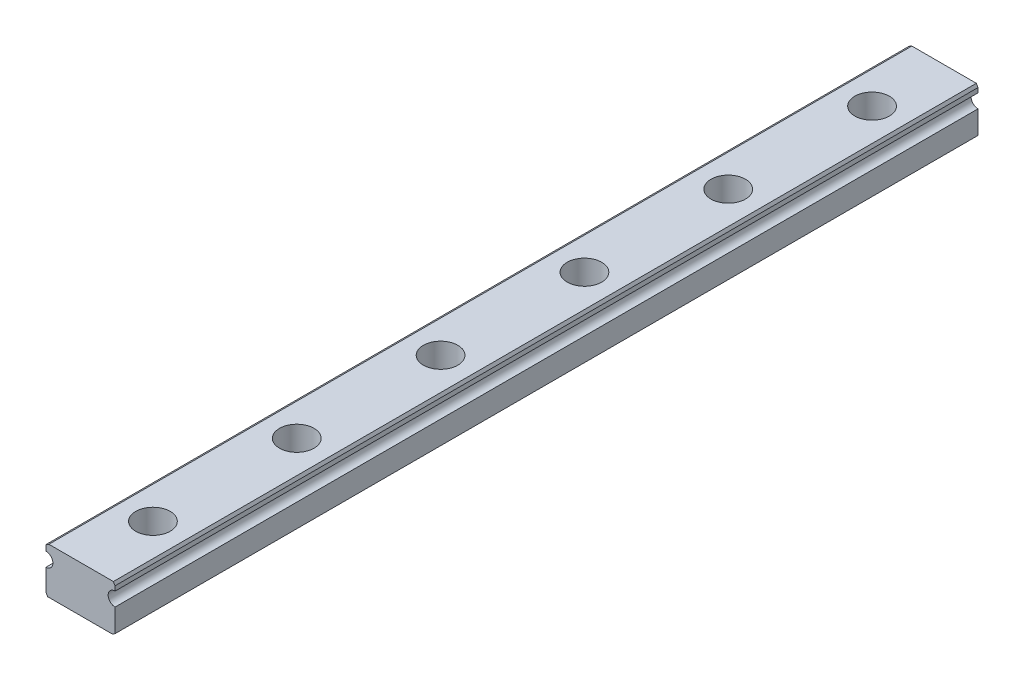
ISO-10303-21;
HEADER;
FILE_DESCRIPTION(('STEP AP214'),'2;1');
FILE_NAME('part.step','',(''),(''),'','','');
FILE_SCHEMA(('AUTOMOTIVE_DESIGN { 1 0 10303 214 1 1 1 1 }'));
ENDSEC;
DATA;
#1=APPLICATION_CONTEXT('core data for automotive mechanical design processes');
#2=APPLICATION_PROTOCOL_DEFINITION('international standard','automotive_design',2000,#1);
#3=PRODUCT_CONTEXT('',#1,'mechanical');
#4=PRODUCT('Part','Part','',(#3));
#5=PRODUCT_RELATED_PRODUCT_CATEGORY('part','',(#4));
#6=PRODUCT_DEFINITION_FORMATION('','',#4);
#7=PRODUCT_DEFINITION_CONTEXT('part definition',#1,'design');
#8=PRODUCT_DEFINITION('design','',#6,#7);
#9=PRODUCT_DEFINITION_SHAPE('','',#8);
#10=(LENGTH_UNIT() NAMED_UNIT(*) SI_UNIT(.MILLI.,.METRE.));
#11=(NAMED_UNIT(*) PLANE_ANGLE_UNIT() SI_UNIT($,.RADIAN.));
#12=(NAMED_UNIT(*) SI_UNIT($,.STERADIAN.) SOLID_ANGLE_UNIT());
#13=UNCERTAINTY_MEASURE_WITH_UNIT(LENGTH_MEASURE(1.E-05),#10,'distance_accuracy_value','');
#14=(GEOMETRIC_REPRESENTATION_CONTEXT(3) GLOBAL_UNCERTAINTY_ASSIGNED_CONTEXT((#13)) GLOBAL_UNIT_ASSIGNED_CONTEXT((#10,
#11,#12)) REPRESENTATION_CONTEXT('',''));
#15=CARTESIAN_POINT('',(0.,0.,0.));
#16=DIRECTION('',(0.,0.,1.));
#17=DIRECTION('',(1.,0.,0.));
#18=AXIS2_PLACEMENT_3D('',#15,#16,#17);
#19=CARTESIAN_POINT('',(0.0880520272521562,-4.001,-62.5));
#20=DIRECTION('',(0.,1.,0.));
#21=DIRECTION('',(0.,0.,1.));
#22=AXIS2_PLACEMENT_3D('',#19,#20,#21);
#23=CYLINDRICAL_SURFACE('',#22,1.75);
#24=CARTESIAN_POINT('',(0.0880520272521562,-4.,-62.5));
#25=DIRECTION('',(0.,1.,0.));
#26=DIRECTION('',(0.,0.,1.));
#27=AXIS2_PLACEMENT_3D('',#24,#25,#26);
#28=CIRCLE('',#27,1.75);
#29=CARTESIAN_POINT('',(0.0880520272521562,-4.,-60.75));
#30=VERTEX_POINT('',#29);
#31=EDGE_CURVE('E239',#30,#30,#28,.F.);
#32=ORIENTED_EDGE('',*,*,#31,.T.);
#33=EDGE_LOOP('',(#32));
#34=FACE_BOUND('',#33,.T.);
#35=CARTESIAN_POINT('',(0.0880520272521562,-0.5,-62.5));
#36=DIRECTION('',(0.,1.,0.));
#37=DIRECTION('',(0.,0.,1.));
#38=AXIS2_PLACEMENT_3D('',#35,#36,#37);
#39=CIRCLE('',#38,1.75);
#40=CARTESIAN_POINT('',(0.0880520272521562,-0.5,-60.75));
#41=VERTEX_POINT('',#40);
#42=EDGE_CURVE('E44',#41,#41,#39,.F.);
#43=ORIENTED_EDGE('',*,*,#42,.F.);
#44=EDGE_LOOP('',(#43));
#45=FACE_BOUND('',#44,.T.);
#46=ADVANCED_FACE('F39',(#34,#45),#23,.F.);
#47=CARTESIAN_POINT('',(0.0880520272521562,-4.001,-37.5));
#48=DIRECTION('',(0.,1.,0.));
#49=DIRECTION('',(0.,0.,1.));
#50=AXIS2_PLACEMENT_3D('',#47,#48,#49);
#51=CYLINDRICAL_SURFACE('',#50,1.75);
#52=CARTESIAN_POINT('',(0.0880520272521562,-4.,-37.5));
#53=DIRECTION('',(0.,1.,0.));
#54=DIRECTION('',(0.,0.,1.));
#55=AXIS2_PLACEMENT_3D('',#52,#53,#54);
#56=CIRCLE('',#55,1.75);
#57=CARTESIAN_POINT('',(0.0880520272521562,-4.,-35.75));
#58=VERTEX_POINT('',#57);
#59=EDGE_CURVE('E243',#58,#58,#56,.F.);
#60=ORIENTED_EDGE('',*,*,#59,.T.);
#61=EDGE_LOOP('',(#60));
#62=FACE_BOUND('',#61,.T.);
#63=CARTESIAN_POINT('',(0.0880520272521562,-0.5,-37.5));
#64=DIRECTION('',(0.,1.,0.));
#65=DIRECTION('',(0.,0.,1.));
#66=AXIS2_PLACEMENT_3D('',#63,#64,#65);
#67=CIRCLE('',#66,1.75);
#68=CARTESIAN_POINT('',(0.0880520272521562,-0.5,-35.75));
#69=VERTEX_POINT('',#68);
#70=EDGE_CURVE('E234',#69,#69,#67,.F.);
#71=ORIENTED_EDGE('',*,*,#70,.F.);
#72=EDGE_LOOP('',(#71));
#73=FACE_BOUND('',#72,.T.);
#74=ADVANCED_FACE('F316',(#62,#73),#51,.F.);
#75=CARTESIAN_POINT('',(0.0880520272521562,-4.001,-12.5));
#76=DIRECTION('',(0.,1.,0.));
#77=DIRECTION('',(0.,0.,1.));
#78=AXIS2_PLACEMENT_3D('',#75,#76,#77);
#79=CYLINDRICAL_SURFACE('',#78,1.75);
#80=CARTESIAN_POINT('',(0.0880520272521562,-4.,-12.5));
#81=DIRECTION('',(0.,1.,0.));
#82=DIRECTION('',(0.,0.,1.));
#83=AXIS2_PLACEMENT_3D('',#80,#81,#82);
#84=CIRCLE('',#83,1.75);
#85=CARTESIAN_POINT('',(0.0880520272521562,-4.,-10.75));
#86=VERTEX_POINT('',#85);
#87=EDGE_CURVE('E248',#86,#86,#84,.F.);
#88=ORIENTED_EDGE('',*,*,#87,.T.);
#89=EDGE_LOOP('',(#88));
#90=FACE_BOUND('',#89,.T.);
#91=CARTESIAN_POINT('',(0.0880520272521562,-0.5,-12.5));
#92=DIRECTION('',(0.,1.,0.));
#93=DIRECTION('',(0.,0.,1.));
#94=AXIS2_PLACEMENT_3D('',#91,#92,#93);
#95=CIRCLE('',#94,1.75);
#96=CARTESIAN_POINT('',(0.0880520272521562,-0.5,-10.75));
#97=VERTEX_POINT('',#96);
#98=EDGE_CURVE('E232',#97,#97,#95,.F.);
#99=ORIENTED_EDGE('',*,*,#98,.F.);
#100=EDGE_LOOP('',(#99));
#101=FACE_BOUND('',#100,.T.);
#102=ADVANCED_FACE('F321',(#90,#101),#79,.F.);
#103=CARTESIAN_POINT('',(0.0880520272521562,-4.001,12.5));
#104=DIRECTION('',(0.,1.,0.));
#105=DIRECTION('',(0.,0.,1.));
#106=AXIS2_PLACEMENT_3D('',#103,#104,#105);
#107=CYLINDRICAL_SURFACE('',#106,1.75);
#108=CARTESIAN_POINT('',(0.0880520272521562,-4.,12.5));
#109=DIRECTION('',(0.,1.,0.));
#110=DIRECTION('',(0.,0.,1.));
#111=AXIS2_PLACEMENT_3D('',#108,#109,#110);
#112=CIRCLE('',#111,1.75);
#113=CARTESIAN_POINT('',(0.0880520272521562,-4.,14.25));
#114=VERTEX_POINT('',#113);
#115=EDGE_CURVE('E596',#114,#114,#112,.F.);
#116=ORIENTED_EDGE('',*,*,#115,.T.);
#117=EDGE_LOOP('',(#116));
#118=FACE_BOUND('',#117,.T.);
#119=CARTESIAN_POINT('',(0.0880520272521562,-0.5,12.5));
#120=DIRECTION('',(0.,1.,0.));
#121=DIRECTION('',(0.,0.,1.));
#122=AXIS2_PLACEMENT_3D('',#119,#120,#121);
#123=CIRCLE('',#122,1.75);
#124=CARTESIAN_POINT('',(0.0880520272521562,-0.5,14.25));
#125=VERTEX_POINT('',#124);
#126=EDGE_CURVE('E228',#125,#125,#123,.F.);
#127=ORIENTED_EDGE('',*,*,#126,.F.);
#128=EDGE_LOOP('',(#127));
#129=FACE_BOUND('',#128,.T.);
#130=ADVANCED_FACE('F518',(#118,#129),#107,.F.);
#131=CARTESIAN_POINT('',(0.0880520272521562,-4.001,37.5));
#132=DIRECTION('',(0.,1.,0.));
#133=DIRECTION('',(0.,0.,1.));
#134=AXIS2_PLACEMENT_3D('',#131,#132,#133);
#135=CYLINDRICAL_SURFACE('',#134,1.75);
#136=CARTESIAN_POINT('',(0.0880520272521562,-4.,37.5));
#137=DIRECTION('',(0.,1.,0.));
#138=DIRECTION('',(0.,0.,1.));
#139=AXIS2_PLACEMENT_3D('',#136,#137,#138);
#140=CIRCLE('',#139,1.75);
#141=CARTESIAN_POINT('',(0.0880520272521562,-4.,39.25));
#142=VERTEX_POINT('',#141);
#143=EDGE_CURVE('E257',#142,#142,#140,.F.);
#144=ORIENTED_EDGE('',*,*,#143,.T.);
#145=EDGE_LOOP('',(#144));
#146=FACE_BOUND('',#145,.T.);
#147=CARTESIAN_POINT('',(0.0880520272521562,-0.5,37.5));
#148=DIRECTION('',(0.,1.,0.));
#149=DIRECTION('',(0.,0.,1.));
#150=AXIS2_PLACEMENT_3D('',#147,#148,#149);
#151=CIRCLE('',#150,1.75);
#152=CARTESIAN_POINT('',(0.0880520272521562,-0.5,39.25));
#153=VERTEX_POINT('',#152);
#154=EDGE_CURVE('E225',#153,#153,#151,.F.);
#155=ORIENTED_EDGE('',*,*,#154,.F.);
#156=EDGE_LOOP('',(#155));
#157=FACE_BOUND('',#156,.T.);
#158=ADVANCED_FACE('F338',(#146,#157),#135,.F.);
#159=CARTESIAN_POINT('',(0.0880520272521562,-4.001,62.5));
#160=DIRECTION('',(0.,1.,0.));
#161=DIRECTION('',(0.,0.,1.));
#162=AXIS2_PLACEMENT_3D('',#159,#160,#161);
#163=CYLINDRICAL_SURFACE('',#162,1.75);
#164=CARTESIAN_POINT('',(0.0880520272521562,-4.,62.5));
#165=DIRECTION('',(0.,1.,0.));
#166=DIRECTION('',(0.,0.,1.));
#167=AXIS2_PLACEMENT_3D('',#164,#165,#166);
#168=CIRCLE('',#167,1.75);
#169=CARTESIAN_POINT('',(0.0880520272521562,-4.,64.25));
#170=VERTEX_POINT('',#169);
#171=EDGE_CURVE('E169',#170,#170,#168,.F.);
#172=ORIENTED_EDGE('',*,*,#171,.T.);
#173=EDGE_LOOP('',(#172));
#174=FACE_BOUND('',#173,.T.);
#175=CARTESIAN_POINT('',(0.0880520272521562,-0.5,62.5));
#176=DIRECTION('',(0.,1.,0.));
#177=DIRECTION('',(0.,0.,1.));
#178=AXIS2_PLACEMENT_3D('',#175,#176,#177);
#179=CIRCLE('',#178,1.75);
#180=CARTESIAN_POINT('',(0.0880520272521562,-0.5,64.25));
#181=VERTEX_POINT('',#180);
#182=EDGE_CURVE('E221',#181,#181,#179,.F.);
#183=ORIENTED_EDGE('',*,*,#182,.F.);
#184=EDGE_LOOP('',(#183));
#185=FACE_BOUND('',#184,.T.);
#186=ADVANCED_FACE('F311',(#174,#185),#163,.F.);
#187=CARTESIAN_POINT('',(6.,2.7,75.));
#188=DIRECTION('',(-1.,0.,0.));
#189=DIRECTION('',(0.,0.,1.));
#190=AXIS2_PLACEMENT_3D('',#187,#188,#189);
#191=PLANE('',#190);
#192=DIRECTION('',(0.,1.,0.));
#193=VECTOR('',#192,1.);
#194=CARTESIAN_POINT('',(6.,2.7,-75.));
#195=LINE('',#194,#193);
#196=CARTESIAN_POINT('',(6.,2.7,-75.));
#197=VERTEX_POINT('',#196);
#198=CARTESIAN_POINT('',(6.,3.49999999999997,-75.));
#199=VERTEX_POINT('',#198);
#200=EDGE_CURVE('E165',#197,#199,#195,.T.);
#201=ORIENTED_EDGE('',*,*,#200,.T.);
#202=DIRECTION('',(0.,0.,1.));
#203=VECTOR('',#202,1.);
#204=CARTESIAN_POINT('',(6.,3.49999999999997,75.));
#205=LINE('',#204,#203);
#206=CARTESIAN_POINT('',(6.,3.49999999999997,75.));
#207=VERTEX_POINT('',#206);
#208=EDGE_CURVE('E49',#199,#207,#205,.T.);
#209=ORIENTED_EDGE('',*,*,#208,.T.);
#210=DIRECTION('',(0.,1.,0.));
#211=VECTOR('',#210,1.);
#212=CARTESIAN_POINT('',(6.,2.7,75.));
#213=LINE('',#212,#211);
#214=CARTESIAN_POINT('',(6.,2.7,75.));
#215=VERTEX_POINT('',#214);
#216=EDGE_CURVE('E185',#215,#207,#213,.T.);
#217=ORIENTED_EDGE('',*,*,#216,.F.);
#218=DIRECTION('',(0.,0.,-1.));
#219=VECTOR('',#218,1.);
#220=CARTESIAN_POINT('',(6.,2.7,75.));
#221=LINE('',#220,#219);
#222=EDGE_CURVE('E164',#215,#197,#221,.T.);
#223=ORIENTED_EDGE('',*,*,#222,.T.);
#224=EDGE_LOOP('',(#201,#209,#217,#223));
#225=FACE_BOUND('',#224,.T.);
#226=ADVANCED_FACE('F298',(#225),#191,.F.);
#227=CARTESIAN_POINT('',(-6.,4.,75.));
#228=DIRECTION('',(0.,-1.,0.));
#229=DIRECTION('',(0.,0.,-1.));
#230=AXIS2_PLACEMENT_3D('',#227,#228,#229);
#231=PLANE('',#230);
#232=CARTESIAN_POINT('',(0.0880520272521562,4.,37.5));
#233=DIRECTION('',(0.,1.,0.));
#234=DIRECTION('',(0.,0.,1.));
#235=AXIS2_PLACEMENT_3D('',#232,#233,#234);
#236=CIRCLE('',#235,3.);
#237=CARTESIAN_POINT('',(0.0880520272521562,4.,40.5));
#238=VERTEX_POINT('',#237);
#239=EDGE_CURVE('E640',#238,#238,#236,.T.);
#240=ORIENTED_EDGE('',*,*,#239,.F.);
#241=EDGE_LOOP('',(#240));
#242=FACE_BOUND('',#241,.T.);
#243=CARTESIAN_POINT('',(0.0880520272521562,4.,12.5));
#244=DIRECTION('',(0.,1.,0.));
#245=DIRECTION('',(0.,0.,1.));
#246=AXIS2_PLACEMENT_3D('',#243,#244,#245);
#247=CIRCLE('',#246,3.);
#248=CARTESIAN_POINT('',(0.0880520272521562,4.,15.5));
#249=VERTEX_POINT('',#248);
#250=EDGE_CURVE('E634',#249,#249,#247,.T.);
#251=ORIENTED_EDGE('',*,*,#250,.F.);
#252=EDGE_LOOP('',(#251));
#253=FACE_BOUND('',#252,.T.);
#254=CARTESIAN_POINT('',(0.0880520272521562,4.,-12.5));
#255=DIRECTION('',(0.,1.,0.));
#256=DIRECTION('',(0.,0.,1.));
#257=AXIS2_PLACEMENT_3D('',#254,#255,#256);
#258=CIRCLE('',#257,3.);
#259=CARTESIAN_POINT('',(0.0880520272521562,4.,-9.50000000000001));
#260=VERTEX_POINT('',#259);
#261=EDGE_CURVE('E628',#260,#260,#258,.T.);
#262=ORIENTED_EDGE('',*,*,#261,.F.);
#263=EDGE_LOOP('',(#262));
#264=FACE_BOUND('',#263,.T.);
#265=CARTESIAN_POINT('',(0.0880520272521562,4.,-37.5));
#266=DIRECTION('',(0.,1.,0.));
#267=DIRECTION('',(0.,0.,1.));
#268=AXIS2_PLACEMENT_3D('',#265,#266,#267);
#269=CIRCLE('',#268,3.);
#270=CARTESIAN_POINT('',(0.0880520272521562,4.,-34.5));
#271=VERTEX_POINT('',#270);
#272=EDGE_CURVE('E622',#271,#271,#269,.T.);
#273=ORIENTED_EDGE('',*,*,#272,.F.);
#274=EDGE_LOOP('',(#273));
#275=FACE_BOUND('',#274,.T.);
#276=CARTESIAN_POINT('',(0.0880520272521562,4.,-62.5));
#277=DIRECTION('',(0.,1.,0.));
#278=DIRECTION('',(0.,0.,1.));
#279=AXIS2_PLACEMENT_3D('',#276,#277,#278);
#280=CIRCLE('',#279,3.);
#281=CARTESIAN_POINT('',(0.0880520272521562,4.,-59.5));
#282=VERTEX_POINT('',#281);
#283=EDGE_CURVE('E601',#282,#282,#280,.T.);
#284=ORIENTED_EDGE('',*,*,#283,.F.);
#285=EDGE_LOOP('',(#284));
#286=FACE_BOUND('',#285,.T.);
#287=CARTESIAN_POINT('',(0.0880520272521562,4.,62.5));
#288=DIRECTION('',(0.,1.,0.));
#289=DIRECTION('',(0.,0.,1.));
#290=AXIS2_PLACEMENT_3D('',#287,#288,#289);
#291=CIRCLE('',#290,3.);
#292=CARTESIAN_POINT('',(0.0880520272521562,4.,65.5));
#293=VERTEX_POINT('',#292);
#294=EDGE_CURVE('E254',#293,#293,#291,.T.);
#295=ORIENTED_EDGE('',*,*,#294,.F.);
#296=EDGE_LOOP('',(#295));
#297=FACE_BOUND('',#296,.T.);
#298=DIRECTION('',(-1.,0.,0.));
#299=VECTOR('',#298,1.);
#300=CARTESIAN_POINT('',(-6.,4.,75.));
#301=LINE('',#300,#299);
#302=CARTESIAN_POINT('',(5.71132486540518,4.,75.));
#303=VERTEX_POINT('',#302);
#304=CARTESIAN_POINT('',(-5.5,4.,75.));
#305=VERTEX_POINT('',#304);
#306=EDGE_CURVE('E138',#303,#305,#301,.T.);
#307=ORIENTED_EDGE('',*,*,#306,.F.);
#308=DIRECTION('',(0.,0.,-1.));
#309=VECTOR('',#308,1.);
#310=CARTESIAN_POINT('',(5.71132486540518,4.,75.));
#311=LINE('',#310,#309);
#312=CARTESIAN_POINT('',(5.71132486540518,4.,-75.));
#313=VERTEX_POINT('',#312);
#314=EDGE_CURVE('E217',#303,#313,#311,.T.);
#315=ORIENTED_EDGE('',*,*,#314,.T.);
#316=DIRECTION('',(-1.,0.,0.));
#317=VECTOR('',#316,1.);
#318=CARTESIAN_POINT('',(-6.,4.,-75.));
#319=LINE('',#318,#317);
#320=CARTESIAN_POINT('',(-5.5,4.,-75.));
#321=VERTEX_POINT('',#320);
#322=EDGE_CURVE('E168',#313,#321,#319,.T.);
#323=ORIENTED_EDGE('',*,*,#322,.T.);
#324=DIRECTION('',(0.,0.,1.));
#325=VECTOR('',#324,1.);
#326=CARTESIAN_POINT('',(-5.5,4.,75.));
#327=LINE('',#326,#325);
#328=EDGE_CURVE('E215',#321,#305,#327,.T.);
#329=ORIENTED_EDGE('',*,*,#328,.T.);
#330=EDGE_LOOP('',(#307,#315,#323,#329));
#331=FACE_BOUND('',#330,.T.);
#332=ADVANCED_FACE('F302',(#242,#253,#264,#275,#286,#297,#331),#231,.F.);
#333=CARTESIAN_POINT('',(-6.,2.7,75.));
#334=DIRECTION('',(1.,0.,0.));
#335=DIRECTION('',(0.,0.,-1.));
#336=AXIS2_PLACEMENT_3D('',#333,#334,#335);
#337=PLANE('',#336);
#338=DIRECTION('',(0.,-1.,0.));
#339=VECTOR('',#338,1.);
#340=CARTESIAN_POINT('',(-6.,2.7,75.));
#341=LINE('',#340,#339);
#342=CARTESIAN_POINT('',(-6.,3.71132486540519,75.));
#343=VERTEX_POINT('',#342);
#344=CARTESIAN_POINT('',(-6.,2.7,75.));
#345=VERTEX_POINT('',#344);
#346=EDGE_CURVE('E129',#343,#345,#341,.T.);
#347=ORIENTED_EDGE('',*,*,#346,.F.);
#348=DIRECTION('',(0.,0.,-1.));
#349=VECTOR('',#348,1.);
#350=CARTESIAN_POINT('',(-6.,3.71132486540519,75.));
#351=LINE('',#350,#349);
#352=CARTESIAN_POINT('',(-6.,3.71132486540519,-75.));
#353=VERTEX_POINT('',#352);
#354=EDGE_CURVE('E11',#343,#353,#351,.T.);
#355=ORIENTED_EDGE('',*,*,#354,.T.);
#356=DIRECTION('',(0.,-1.,0.));
#357=VECTOR('',#356,1.);
#358=CARTESIAN_POINT('',(-6.,2.7,-75.));
#359=LINE('',#358,#357);
#360=CARTESIAN_POINT('',(-6.,2.7,-75.));
#361=VERTEX_POINT('',#360);
#362=EDGE_CURVE('E144',#353,#361,#359,.T.);
#363=ORIENTED_EDGE('',*,*,#362,.T.);
#364=DIRECTION('',(0.,0.,-1.));
#365=VECTOR('',#364,1.);
#366=CARTESIAN_POINT('',(-6.,2.7,75.));
#367=LINE('',#366,#365);
#368=EDGE_CURVE('E141',#345,#361,#367,.T.);
#369=ORIENTED_EDGE('',*,*,#368,.F.);
#370=EDGE_LOOP('',(#347,#355,#363,#369));
#371=FACE_BOUND('',#370,.T.);
#372=ADVANCED_FACE('F142',(#371),#337,.F.);
#373=CARTESIAN_POINT('',(-6.,1.5,75.));
#374=DIRECTION('',(0.,0.,-1.));
#375=DIRECTION('',(-1.,0.,0.));
#376=AXIS2_PLACEMENT_3D('',#373,#374,#375);
#377=CYLINDRICAL_SURFACE('',#376,1.2);
#378=CARTESIAN_POINT('',(-6.,1.5,-75.));
#379=DIRECTION('',(0.,0.,-1.));
#380=DIRECTION('',(1.,0.,0.));
#381=AXIS2_PLACEMENT_3D('',#378,#379,#380);
#382=CIRCLE('',#381,1.2);
#383=CARTESIAN_POINT('',(-6.,0.3,-75.));
#384=VERTEX_POINT('',#383);
#385=EDGE_CURVE('E173',#361,#384,#382,.T.);
#386=ORIENTED_EDGE('',*,*,#385,.T.);
#387=DIRECTION('',(0.,0.,-1.));
#388=VECTOR('',#387,1.);
#389=CARTESIAN_POINT('',(-6.,0.3,75.));
#390=LINE('',#389,#388);
#391=CARTESIAN_POINT('',(-6.,0.3,75.));
#392=VERTEX_POINT('',#391);
#393=EDGE_CURVE('E148',#392,#384,#390,.T.);
#394=ORIENTED_EDGE('',*,*,#393,.F.);
#395=CARTESIAN_POINT('',(-6.,1.5,75.));
#396=DIRECTION('',(0.,0.,-1.));
#397=DIRECTION('',(1.,0.,0.));
#398=AXIS2_PLACEMENT_3D('',#395,#396,#397);
#399=CIRCLE('',#398,1.2);
#400=EDGE_CURVE('E134',#345,#392,#399,.T.);
#401=ORIENTED_EDGE('',*,*,#400,.F.);
#402=ORIENTED_EDGE('',*,*,#368,.T.);
#403=EDGE_LOOP('',(#386,#394,#401,#402));
#404=FACE_BOUND('',#403,.T.);
#405=ADVANCED_FACE('F150',(#404),#377,.F.);
#406=CARTESIAN_POINT('',(-6.,-4.,75.));
#407=DIRECTION('',(1.,0.,0.));
#408=DIRECTION('',(0.,0.,-1.));
#409=AXIS2_PLACEMENT_3D('',#406,#407,#408);
#410=PLANE('',#409);
#411=DIRECTION('',(0.,-1.,0.));
#412=VECTOR('',#411,1.);
#413=CARTESIAN_POINT('',(-6.,-4.,-75.));
#414=LINE('',#413,#412);
#415=CARTESIAN_POINT('',(-6.,-3.5,-75.));
#416=VERTEX_POINT('',#415);
#417=EDGE_CURVE('E175',#384,#416,#414,.T.);
#418=ORIENTED_EDGE('',*,*,#417,.T.);
#419=DIRECTION('',(0.,0.,1.));
#420=VECTOR('',#419,1.);
#421=CARTESIAN_POINT('',(-6.,-3.5,75.));
#422=LINE('',#421,#420);
#423=CARTESIAN_POINT('',(-6.,-3.5,75.));
#424=VERTEX_POINT('',#423);
#425=EDGE_CURVE('E204',#416,#424,#422,.T.);
#426=ORIENTED_EDGE('',*,*,#425,.T.);
#427=DIRECTION('',(0.,-1.,0.));
#428=VECTOR('',#427,1.);
#429=CARTESIAN_POINT('',(-6.,-4.,75.));
#430=LINE('',#429,#428);
#431=EDGE_CURVE('E153',#392,#424,#430,.T.);
#432=ORIENTED_EDGE('',*,*,#431,.F.);
#433=ORIENTED_EDGE('',*,*,#393,.T.);
#434=EDGE_LOOP('',(#418,#426,#432,#433));
#435=FACE_BOUND('',#434,.T.);
#436=ADVANCED_FACE('F273',(#435),#410,.F.);
#437=CARTESIAN_POINT('',(-6.,-4.,75.));
#438=DIRECTION('',(0.,1.,0.));
#439=DIRECTION('',(0.,0.,1.));
#440=AXIS2_PLACEMENT_3D('',#437,#438,#439);
#441=PLANE('',#440);
#442=ORIENTED_EDGE('',*,*,#143,.F.);
#443=EDGE_LOOP('',(#442));
#444=FACE_BOUND('',#443,.T.);
#445=ORIENTED_EDGE('',*,*,#115,.F.);
#446=EDGE_LOOP('',(#445));
#447=FACE_BOUND('',#446,.T.);
#448=ORIENTED_EDGE('',*,*,#87,.F.);
#449=EDGE_LOOP('',(#448));
#450=FACE_BOUND('',#449,.T.);
#451=ORIENTED_EDGE('',*,*,#59,.F.);
#452=EDGE_LOOP('',(#451));
#453=FACE_BOUND('',#452,.T.);
#454=ORIENTED_EDGE('',*,*,#31,.F.);
#455=EDGE_LOOP('',(#454));
#456=FACE_BOUND('',#455,.T.);
#457=ORIENTED_EDGE('',*,*,#171,.F.);
#458=EDGE_LOOP('',(#457));
#459=FACE_BOUND('',#458,.T.);
#460=DIRECTION('',(1.,0.,0.));
#461=VECTOR('',#460,1.);
#462=CARTESIAN_POINT('',(-6.,-4.,75.));
#463=LINE('',#462,#461);
#464=CARTESIAN_POINT('',(-5.71132486540519,-4.,75.));
#465=VERTEX_POINT('',#464);
#466=CARTESIAN_POINT('',(5.5,-4.,75.));
#467=VERTEX_POINT('',#466);
#468=EDGE_CURVE('E155',#465,#467,#463,.T.);
#469=ORIENTED_EDGE('',*,*,#468,.F.);
#470=DIRECTION('',(0.,0.,-1.));
#471=VECTOR('',#470,1.);
#472=CARTESIAN_POINT('',(-5.71132486540519,-4.,75.));
#473=LINE('',#472,#471);
#474=CARTESIAN_POINT('',(-5.71132486540519,-4.,-75.));
#475=VERTEX_POINT('',#474);
#476=EDGE_CURVE('E193',#465,#475,#473,.T.);
#477=ORIENTED_EDGE('',*,*,#476,.T.);
#478=DIRECTION('',(1.,0.,0.));
#479=VECTOR('',#478,1.);
#480=CARTESIAN_POINT('',(-6.,-4.,-75.));
#481=LINE('',#480,#479);
#482=CARTESIAN_POINT('',(5.5,-4.,-75.));
#483=VERTEX_POINT('',#482);
#484=EDGE_CURVE('E178',#475,#483,#481,.T.);
#485=ORIENTED_EDGE('',*,*,#484,.T.);
#486=DIRECTION('',(0.,0.,1.));
#487=VECTOR('',#486,1.);
#488=CARTESIAN_POINT('',(5.5,-4.,75.));
#489=LINE('',#488,#487);
#490=EDGE_CURVE('E147',#483,#467,#489,.T.);
#491=ORIENTED_EDGE('',*,*,#490,.T.);
#492=EDGE_LOOP('',(#469,#477,#485,#491));
#493=FACE_BOUND('',#492,.T.);
#494=ADVANCED_FACE('F281',(#444,#447,#450,#453,#456,#459,#493),#441,.F.);
#495=CARTESIAN_POINT('',(6.,-4.,75.));
#496=DIRECTION('',(-1.,0.,0.));
#497=DIRECTION('',(0.,0.,1.));
#498=AXIS2_PLACEMENT_3D('',#495,#496,#497);
#499=PLANE('',#498);
#500=DIRECTION('',(0.,1.,0.));
#501=VECTOR('',#500,1.);
#502=CARTESIAN_POINT('',(6.,-4.,75.));
#503=LINE('',#502,#501);
#504=CARTESIAN_POINT('',(6.,-3.71132486540519,75.));
#505=VERTEX_POINT('',#504);
#506=CARTESIAN_POINT('',(6.,0.3,75.));
#507=VERTEX_POINT('',#506);
#508=EDGE_CURVE('E160',#505,#507,#503,.T.);
#509=ORIENTED_EDGE('',*,*,#508,.F.);
#510=DIRECTION('',(0.,0.,-1.));
#511=VECTOR('',#510,1.);
#512=CARTESIAN_POINT('',(6.,-3.71132486540519,75.));
#513=LINE('',#512,#511);
#514=CARTESIAN_POINT('',(6.,-3.71132486540519,-75.));
#515=VERTEX_POINT('',#514);
#516=EDGE_CURVE('E212',#505,#515,#513,.T.);
#517=ORIENTED_EDGE('',*,*,#516,.T.);
#518=DIRECTION('',(0.,1.,0.));
#519=VECTOR('',#518,1.);
#520=CARTESIAN_POINT('',(6.,-4.,-75.));
#521=LINE('',#520,#519);
#522=CARTESIAN_POINT('',(6.,0.3,-75.));
#523=VERTEX_POINT('',#522);
#524=EDGE_CURVE('E181',#515,#523,#521,.T.);
#525=ORIENTED_EDGE('',*,*,#524,.T.);
#526=DIRECTION('',(0.,0.,-1.));
#527=VECTOR('',#526,1.);
#528=CARTESIAN_POINT('',(6.,0.3,75.));
#529=LINE('',#528,#527);
#530=EDGE_CURVE('E188',#507,#523,#529,.T.);
#531=ORIENTED_EDGE('',*,*,#530,.F.);
#532=EDGE_LOOP('',(#509,#517,#525,#531));
#533=FACE_BOUND('',#532,.T.);
#534=ADVANCED_FACE('F289',(#533),#499,.F.);
#535=CARTESIAN_POINT('',(6.,1.5,75.));
#536=DIRECTION('',(0.,0.,-1.));
#537=DIRECTION('',(-1.,0.,0.));
#538=AXIS2_PLACEMENT_3D('',#535,#536,#537);
#539=CYLINDRICAL_SURFACE('',#538,1.2);
#540=CARTESIAN_POINT('',(6.,1.5,-75.));
#541=DIRECTION('',(0.,0.,-1.));
#542=DIRECTION('',(-1.,0.,0.));
#543=AXIS2_PLACEMENT_3D('',#540,#541,#542);
#544=CIRCLE('',#543,1.2);
#545=EDGE_CURVE('E183',#523,#197,#544,.T.);
#546=ORIENTED_EDGE('',*,*,#545,.T.);
#547=ORIENTED_EDGE('',*,*,#222,.F.);
#548=CARTESIAN_POINT('',(6.,1.5,75.));
#549=DIRECTION('',(0.,0.,-1.));
#550=DIRECTION('',(-1.,0.,0.));
#551=AXIS2_PLACEMENT_3D('',#548,#549,#550);
#552=CIRCLE('',#551,1.2);
#553=EDGE_CURVE('E162',#507,#215,#552,.T.);
#554=ORIENTED_EDGE('',*,*,#553,.F.);
#555=ORIENTED_EDGE('',*,*,#530,.T.);
#556=EDGE_LOOP('',(#546,#547,#554,#555));
#557=FACE_BOUND('',#556,.T.);
#558=ADVANCED_FACE('F295',(#557),#539,.F.);
#559=CARTESIAN_POINT('',(-6.,1.5,75.));
#560=DIRECTION('',(0.,0.,1.));
#561=DIRECTION('',(1.,0.,0.));
#562=AXIS2_PLACEMENT_3D('',#559,#560,#561);
#563=PLANE('',#562);
#564=ORIENTED_EDGE('',*,*,#431,.T.);
#565=DIRECTION('',(-0.499999999999996,0.866025403784441,0.));
#566=VECTOR('',#565,1.);
#567=CARTESIAN_POINT('',(-8.16506350946108,0.250000000000022,75.));
#568=LINE('',#567,#566);
#569=EDGE_CURVE('E210',#424,#465,#568,.F.);
#570=ORIENTED_EDGE('',*,*,#569,.T.);
#571=ORIENTED_EDGE('',*,*,#468,.T.);
#572=DIRECTION('',(-0.866025403784441,-0.499999999999996,0.));
#573=VECTOR('',#572,1.);
#574=CARTESIAN_POINT('',(-0.743430139592861,-7.60464607176052,75.));
#575=LINE('',#574,#573);
#576=EDGE_CURVE('E57',#467,#505,#575,.F.);
#577=ORIENTED_EDGE('',*,*,#576,.T.);
#578=ORIENTED_EDGE('',*,*,#508,.T.);
#579=ORIENTED_EDGE('',*,*,#553,.T.);
#580=ORIENTED_EDGE('',*,*,#216,.T.);
#581=DIRECTION('',(0.499999999999993,-0.866025403784443,0.));
#582=VECTOR('',#581,1.);
#583=CARTESIAN_POINT('',(3.86602540378451,7.19615242270656,75.));
#584=LINE('',#583,#582);
#585=EDGE_CURVE('E207',#207,#303,#584,.F.);
#586=ORIENTED_EDGE('',*,*,#585,.T.);
#587=ORIENTED_EDGE('',*,*,#306,.T.);
#588=DIRECTION('',(0.866025403784441,0.499999999999996,0.));
#589=VECTOR('',#588,1.);
#590=CARTESIAN_POINT('',(-6.95753175473055,3.1584936490539,75.));
#591=LINE('',#590,#589);
#592=EDGE_CURVE('E64',#305,#343,#591,.F.);
#593=ORIENTED_EDGE('',*,*,#592,.T.);
#594=ORIENTED_EDGE('',*,*,#346,.T.);
#595=ORIENTED_EDGE('',*,*,#400,.T.);
#596=EDGE_LOOP('',(#564,#570,#571,#577,#578,#579,#580,#586,#587,#593,#594,#595));
#597=FACE_BOUND('',#596,.T.);
#598=ADVANCED_FACE('F132',(#597),#563,.T.);
#599=CARTESIAN_POINT('',(-6.,1.5,-75.));
#600=DIRECTION('',(0.,0.,1.));
#601=DIRECTION('',(1.,0.,0.));
#602=AXIS2_PLACEMENT_3D('',#599,#600,#601);
#603=PLANE('',#602);
#604=ORIENTED_EDGE('',*,*,#484,.F.);
#605=DIRECTION('',(0.499999999999996,-0.866025403784441,0.));
#606=VECTOR('',#605,1.);
#607=CARTESIAN_POINT('',(-5.71132486540519,-4.,-75.));
#608=LINE('',#607,#606);
#609=EDGE_CURVE('E202',#475,#416,#608,.F.);
#610=ORIENTED_EDGE('',*,*,#609,.T.);
#611=ORIENTED_EDGE('',*,*,#417,.F.);
#612=ORIENTED_EDGE('',*,*,#385,.F.);
#613=ORIENTED_EDGE('',*,*,#362,.F.);
#614=DIRECTION('',(-0.866025403784441,-0.499999999999996,0.));
#615=VECTOR('',#614,1.);
#616=CARTESIAN_POINT('',(-6.,3.71132486540519,-75.));
#617=LINE('',#616,#615);
#618=EDGE_CURVE('E196',#353,#321,#617,.F.);
#619=ORIENTED_EDGE('',*,*,#618,.T.);
#620=ORIENTED_EDGE('',*,*,#322,.F.);
#621=DIRECTION('',(-0.499999999999993,0.866025403784443,0.));
#622=VECTOR('',#621,1.);
#623=CARTESIAN_POINT('',(5.71132486540518,4.,-75.));
#624=LINE('',#623,#622);
#625=EDGE_CURVE('E198',#313,#199,#624,.F.);
#626=ORIENTED_EDGE('',*,*,#625,.T.);
#627=ORIENTED_EDGE('',*,*,#200,.F.);
#628=ORIENTED_EDGE('',*,*,#545,.F.);
#629=ORIENTED_EDGE('',*,*,#524,.F.);
#630=DIRECTION('',(0.866025403784441,0.499999999999996,0.));
#631=VECTOR('',#630,1.);
#632=CARTESIAN_POINT('',(6.,-3.71132486540519,-75.));
#633=LINE('',#632,#631);
#634=EDGE_CURVE('E200',#515,#483,#633,.F.);
#635=ORIENTED_EDGE('',*,*,#634,.T.);
#636=EDGE_LOOP('',(#604,#610,#611,#612,#613,#619,#620,#626,#627,#628,#629,#635));
#637=FACE_BOUND('',#636,.T.);
#638=ADVANCED_FACE('F269',(#637),#603,.F.);
#639=CARTESIAN_POINT('',(-5.71132486540519,-4.,75.));
#640=DIRECTION('',(0.866025403784441,0.499999999999996,0.));
#641=DIRECTION('',(0.,0.,-1.));
#642=AXIS2_PLACEMENT_3D('',#639,#640,#641);
#643=PLANE('',#642);
#644=ORIENTED_EDGE('',*,*,#569,.F.);
#645=ORIENTED_EDGE('',*,*,#425,.F.);
#646=ORIENTED_EDGE('',*,*,#609,.F.);
#647=ORIENTED_EDGE('',*,*,#476,.F.);
#648=EDGE_LOOP('',(#644,#645,#646,#647));
#649=FACE_BOUND('',#648,.T.);
#650=ADVANCED_FACE('F279',(#649),#643,.F.);
#651=CARTESIAN_POINT('',(6.,-3.71132486540519,75.));
#652=DIRECTION('',(-0.499999999999996,0.866025403784441,0.));
#653=DIRECTION('',(0.,0.,-1.));
#654=AXIS2_PLACEMENT_3D('',#651,#652,#653);
#655=PLANE('',#654);
#656=ORIENTED_EDGE('',*,*,#576,.F.);
#657=ORIENTED_EDGE('',*,*,#490,.F.);
#658=ORIENTED_EDGE('',*,*,#634,.F.);
#659=ORIENTED_EDGE('',*,*,#516,.F.);
#660=EDGE_LOOP('',(#656,#657,#658,#659));
#661=FACE_BOUND('',#660,.T.);
#662=ADVANCED_FACE('F287',(#661),#655,.F.);
#663=CARTESIAN_POINT('',(5.71132486540518,4.,75.));
#664=DIRECTION('',(-0.866025403784443,-0.499999999999993,0.));
#665=DIRECTION('',(0.,0.,-1.));
#666=AXIS2_PLACEMENT_3D('',#663,#664,#665);
#667=PLANE('',#666);
#668=ORIENTED_EDGE('',*,*,#585,.F.);
#669=ORIENTED_EDGE('',*,*,#208,.F.);
#670=ORIENTED_EDGE('',*,*,#625,.F.);
#671=ORIENTED_EDGE('',*,*,#314,.F.);
#672=EDGE_LOOP('',(#668,#669,#670,#671));
#673=FACE_BOUND('',#672,.T.);
#674=ADVANCED_FACE('F301',(#673),#667,.F.);
#675=CARTESIAN_POINT('',(-6.,3.71132486540519,75.));
#676=DIRECTION('',(0.499999999999996,-0.866025403784441,0.));
#677=DIRECTION('',(0.,0.,-1.));
#678=AXIS2_PLACEMENT_3D('',#675,#676,#677);
#679=PLANE('',#678);
#680=ORIENTED_EDGE('',*,*,#592,.F.);
#681=ORIENTED_EDGE('',*,*,#328,.F.);
#682=ORIENTED_EDGE('',*,*,#618,.F.);
#683=ORIENTED_EDGE('',*,*,#354,.F.);
#684=EDGE_LOOP('',(#680,#681,#682,#683));
#685=FACE_BOUND('',#684,.T.);
#686=ADVANCED_FACE('F42',(#685),#679,.F.);
#687=CARTESIAN_POINT('',(0.0880520272521562,-0.5,62.5));
#688=DIRECTION('',(0.,1.,0.));
#689=DIRECTION('',(0.,0.,1.));
#690=AXIS2_PLACEMENT_3D('',#687,#688,#689);
#691=PLANE('',#690);
#692=CARTESIAN_POINT('',(0.0880520272521562,-0.5,62.5));
#693=DIRECTION('',(0.,1.,0.));
#694=DIRECTION('',(0.,0.,1.));
#695=AXIS2_PLACEMENT_3D('',#692,#693,#694);
#696=CIRCLE('',#695,3.);
#697=CARTESIAN_POINT('',(0.0880520272521562,-0.5,65.5));
#698=VERTEX_POINT('',#697);
#699=EDGE_CURVE('E224',#698,#698,#696,.T.);
#700=ORIENTED_EDGE('',*,*,#699,.T.);
#701=EDGE_LOOP('',(#700));
#702=FACE_BOUND('',#701,.T.);
#703=ORIENTED_EDGE('',*,*,#182,.T.);
#704=EDGE_LOOP('',(#703));
#705=FACE_BOUND('',#704,.T.);
#706=ADVANCED_FACE('F327',(#702,#705),#691,.T.);
#707=CARTESIAN_POINT('',(0.0880520272521562,-0.5,62.5));
#708=DIRECTION('',(0.,1.,0.));
#709=DIRECTION('',(0.,0.,1.));
#710=AXIS2_PLACEMENT_3D('',#707,#708,#709);
#711=CYLINDRICAL_SURFACE('',#710,3.);
#712=ORIENTED_EDGE('',*,*,#699,.F.);
#713=EDGE_LOOP('',(#712));
#714=FACE_BOUND('',#713,.T.);
#715=ORIENTED_EDGE('',*,*,#294,.T.);
#716=EDGE_LOOP('',(#715));
#717=FACE_BOUND('',#716,.T.);
#718=ADVANCED_FACE('F330',(#714,#717),#711,.F.);
#719=CARTESIAN_POINT('',(0.0880520272521562,-0.5,37.5));
#720=DIRECTION('',(0.,1.,0.));
#721=DIRECTION('',(0.,0.,1.));
#722=AXIS2_PLACEMENT_3D('',#719,#720,#721);
#723=PLANE('',#722);
#724=CARTESIAN_POINT('',(0.0880520272521562,-0.5,37.5));
#725=DIRECTION('',(0.,1.,0.));
#726=DIRECTION('',(0.,0.,1.));
#727=AXIS2_PLACEMENT_3D('',#724,#725,#726);
#728=CIRCLE('',#727,3.);
#729=CARTESIAN_POINT('',(0.0880520272521562,-0.5,40.5));
#730=VERTEX_POINT('',#729);
#731=EDGE_CURVE('E229',#730,#730,#728,.T.);
#732=ORIENTED_EDGE('',*,*,#731,.T.);
#733=EDGE_LOOP('',(#732));
#734=FACE_BOUND('',#733,.T.);
#735=ORIENTED_EDGE('',*,*,#154,.T.);
#736=EDGE_LOOP('',(#735));
#737=FACE_BOUND('',#736,.T.);
#738=ADVANCED_FACE('F334',(#734,#737),#723,.T.);
#739=CARTESIAN_POINT('',(0.0880520272521562,-0.5,37.5));
#740=DIRECTION('',(0.,1.,0.));
#741=DIRECTION('',(0.,0.,1.));
#742=AXIS2_PLACEMENT_3D('',#739,#740,#741);
#743=CYLINDRICAL_SURFACE('',#742,3.);
#744=ORIENTED_EDGE('',*,*,#731,.F.);
#745=EDGE_LOOP('',(#744));
#746=FACE_BOUND('',#745,.T.);
#747=ORIENTED_EDGE('',*,*,#239,.T.);
#748=EDGE_LOOP('',(#747));
#749=FACE_BOUND('',#748,.T.);
#750=ADVANCED_FACE('F422',(#746,#749),#743,.F.);
#751=CARTESIAN_POINT('',(0.0880520272521562,-0.5,12.5));
#752=DIRECTION('',(0.,1.,0.));
#753=DIRECTION('',(0.,0.,1.));
#754=AXIS2_PLACEMENT_3D('',#751,#752,#753);
#755=PLANE('',#754);
#756=CARTESIAN_POINT('',(0.0880520272521562,-0.5,12.5));
#757=DIRECTION('',(0.,1.,0.));
#758=DIRECTION('',(0.,0.,1.));
#759=AXIS2_PLACEMENT_3D('',#756,#757,#758);
#760=CIRCLE('',#759,3.);
#761=CARTESIAN_POINT('',(0.0880520272521562,-0.5,15.5));
#762=VERTEX_POINT('',#761);
#763=EDGE_CURVE('E637',#762,#762,#760,.T.);
#764=ORIENTED_EDGE('',*,*,#763,.T.);
#765=EDGE_LOOP('',(#764));
#766=FACE_BOUND('',#765,.T.);
#767=ORIENTED_EDGE('',*,*,#126,.T.);
#768=EDGE_LOOP('',(#767));
#769=FACE_BOUND('',#768,.T.);
#770=ADVANCED_FACE('F431',(#766,#769),#755,.T.);
#771=CARTESIAN_POINT('',(0.0880520272521562,-0.5,12.5));
#772=DIRECTION('',(0.,1.,0.));
#773=DIRECTION('',(0.,0.,1.));
#774=AXIS2_PLACEMENT_3D('',#771,#772,#773);
#775=CYLINDRICAL_SURFACE('',#774,3.);
#776=ORIENTED_EDGE('',*,*,#763,.F.);
#777=EDGE_LOOP('',(#776));
#778=FACE_BOUND('',#777,.T.);
#779=ORIENTED_EDGE('',*,*,#250,.T.);
#780=EDGE_LOOP('',(#779));
#781=FACE_BOUND('',#780,.T.);
#782=ADVANCED_FACE('F440',(#778,#781),#775,.F.);
#783=CARTESIAN_POINT('',(0.0880520272521562,-0.5,-12.5));
#784=DIRECTION('',(0.,1.,0.));
#785=DIRECTION('',(0.,0.,1.));
#786=AXIS2_PLACEMENT_3D('',#783,#784,#785);
#787=PLANE('',#786);
#788=CARTESIAN_POINT('',(0.0880520272521562,-0.5,-12.5));
#789=DIRECTION('',(0.,1.,0.));
#790=DIRECTION('',(0.,0.,1.));
#791=AXIS2_PLACEMENT_3D('',#788,#789,#790);
#792=CIRCLE('',#791,3.);
#793=CARTESIAN_POINT('',(0.0880520272521562,-0.5,-9.50000000000001));
#794=VERTEX_POINT('',#793);
#795=EDGE_CURVE('E631',#794,#794,#792,.T.);
#796=ORIENTED_EDGE('',*,*,#795,.T.);
#797=EDGE_LOOP('',(#796));
#798=FACE_BOUND('',#797,.T.);
#799=ORIENTED_EDGE('',*,*,#98,.T.);
#800=EDGE_LOOP('',(#799));
#801=FACE_BOUND('',#800,.T.);
#802=ADVANCED_FACE('F448',(#798,#801),#787,.T.);
#803=CARTESIAN_POINT('',(0.0880520272521562,-0.5,-12.5));
#804=DIRECTION('',(0.,1.,0.));
#805=DIRECTION('',(0.,0.,1.));
#806=AXIS2_PLACEMENT_3D('',#803,#804,#805);
#807=CYLINDRICAL_SURFACE('',#806,3.);
#808=ORIENTED_EDGE('',*,*,#795,.F.);
#809=EDGE_LOOP('',(#808));
#810=FACE_BOUND('',#809,.T.);
#811=ORIENTED_EDGE('',*,*,#261,.T.);
#812=EDGE_LOOP('',(#811));
#813=FACE_BOUND('',#812,.T.);
#814=ADVANCED_FACE('F456',(#810,#813),#807,.F.);
#815=CARTESIAN_POINT('',(0.0880520272521562,-0.5,-37.5));
#816=DIRECTION('',(0.,1.,0.));
#817=DIRECTION('',(0.,0.,1.));
#818=AXIS2_PLACEMENT_3D('',#815,#816,#817);
#819=PLANE('',#818);
#820=CARTESIAN_POINT('',(0.0880520272521562,-0.5,-37.5));
#821=DIRECTION('',(0.,1.,0.));
#822=DIRECTION('',(0.,0.,1.));
#823=AXIS2_PLACEMENT_3D('',#820,#821,#822);
#824=CIRCLE('',#823,3.);
#825=CARTESIAN_POINT('',(0.0880520272521562,-0.5,-34.5));
#826=VERTEX_POINT('',#825);
#827=EDGE_CURVE('E625',#826,#826,#824,.T.);
#828=ORIENTED_EDGE('',*,*,#827,.T.);
#829=EDGE_LOOP('',(#828));
#830=FACE_BOUND('',#829,.T.);
#831=ORIENTED_EDGE('',*,*,#70,.T.);
#832=EDGE_LOOP('',(#831));
#833=FACE_BOUND('',#832,.T.);
#834=ADVANCED_FACE('F464',(#830,#833),#819,.T.);
#835=CARTESIAN_POINT('',(0.0880520272521562,-0.5,-37.5));
#836=DIRECTION('',(0.,1.,0.));
#837=DIRECTION('',(0.,0.,1.));
#838=AXIS2_PLACEMENT_3D('',#835,#836,#837);
#839=CYLINDRICAL_SURFACE('',#838,3.);
#840=ORIENTED_EDGE('',*,*,#827,.F.);
#841=EDGE_LOOP('',(#840));
#842=FACE_BOUND('',#841,.T.);
#843=ORIENTED_EDGE('',*,*,#272,.T.);
#844=EDGE_LOOP('',(#843));
#845=FACE_BOUND('',#844,.T.);
#846=ADVANCED_FACE('F471',(#842,#845),#839,.F.);
#847=CARTESIAN_POINT('',(0.0880520272521562,-0.5,-62.5));
#848=DIRECTION('',(0.,1.,0.));
#849=DIRECTION('',(0.,0.,1.));
#850=AXIS2_PLACEMENT_3D('',#847,#848,#849);
#851=PLANE('',#850);
#852=CARTESIAN_POINT('',(0.0880520272521562,-0.5,-62.5));
#853=DIRECTION('',(0.,1.,0.));
#854=DIRECTION('',(0.,0.,1.));
#855=AXIS2_PLACEMENT_3D('',#852,#853,#854);
#856=CIRCLE('',#855,3.);
#857=CARTESIAN_POINT('',(0.0880520272521562,-0.5,-59.5));
#858=VERTEX_POINT('',#857);
#859=EDGE_CURVE('E619',#858,#858,#856,.T.);
#860=ORIENTED_EDGE('',*,*,#859,.T.);
#861=EDGE_LOOP('',(#860));
#862=FACE_BOUND('',#861,.T.);
#863=ORIENTED_EDGE('',*,*,#42,.T.);
#864=EDGE_LOOP('',(#863));
#865=FACE_BOUND('',#864,.T.);
#866=ADVANCED_FACE('F478',(#862,#865),#851,.T.);
#867=CARTESIAN_POINT('',(0.0880520272521562,-0.5,-62.5));
#868=DIRECTION('',(0.,1.,0.));
#869=DIRECTION('',(0.,0.,1.));
#870=AXIS2_PLACEMENT_3D('',#867,#868,#869);
#871=CYLINDRICAL_SURFACE('',#870,3.);
#872=ORIENTED_EDGE('',*,*,#859,.F.);
#873=EDGE_LOOP('',(#872));
#874=FACE_BOUND('',#873,.T.);
#875=ORIENTED_EDGE('',*,*,#283,.T.);
#876=EDGE_LOOP('',(#875));
#877=FACE_BOUND('',#876,.T.);
#878=ADVANCED_FACE('F486',(#874,#877),#871,.F.);
#879=CLOSED_SHELL('',(#46,#74,#102,#130,#158,#186,#226,#332,#372,#405,#436,#494,#534,#558,#598,
#638,#650,#662,#674,#686,#706,#718,#738,#750,#770,#782,#802,#814,#834,#846,#866,#878));
#880=MANIFOLD_SOLID_BREP('B2',#879);
#881=ADVANCED_BREP_SHAPE_REPRESENTATION('',(#18,#880),#14);
#882=SHAPE_DEFINITION_REPRESENTATION(#9,#881);
ENDSEC;
END-ISO-10303-21;
